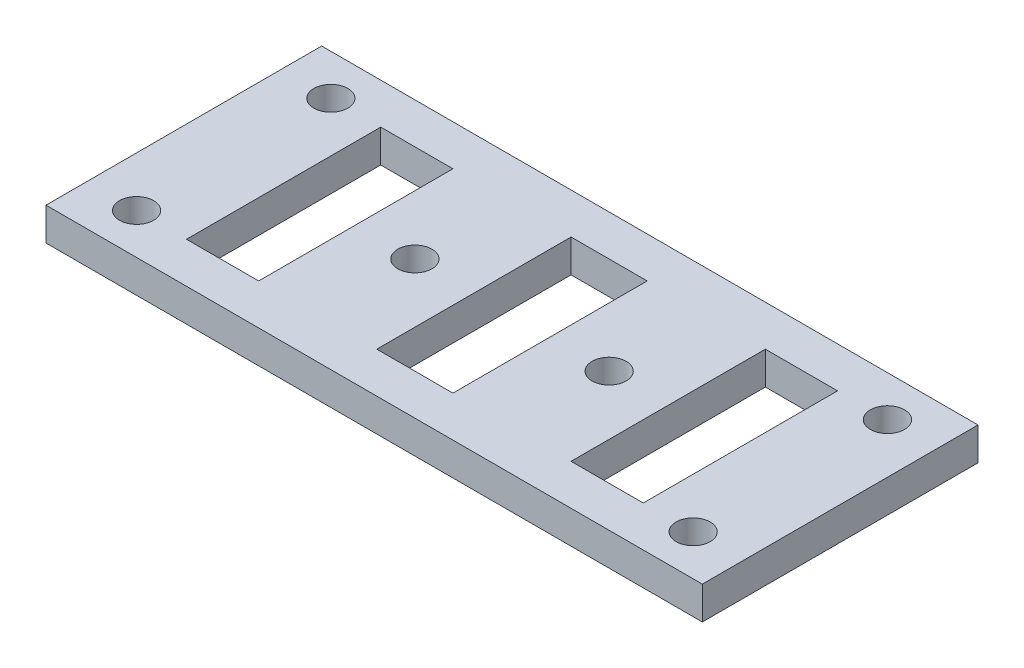
ISO-10303-21;
HEADER;
FILE_DESCRIPTION(('STEP AP214'),'2;1');
FILE_NAME('part.step','',(''),(''),'','','');
FILE_SCHEMA(('AUTOMOTIVE_DESIGN { 1 0 10303 214 1 1 1 1 }'));
ENDSEC;
DATA;
#1=APPLICATION_CONTEXT('core data for automotive mechanical design processes');
#2=APPLICATION_PROTOCOL_DEFINITION('international standard','automotive_design',2000,#1);
#3=PRODUCT_CONTEXT('',#1,'mechanical');
#4=PRODUCT('Part','Part','',(#3));
#5=PRODUCT_RELATED_PRODUCT_CATEGORY('part','',(#4));
#6=PRODUCT_DEFINITION_FORMATION('','',#4);
#7=PRODUCT_DEFINITION_CONTEXT('part definition',#1,'design');
#8=PRODUCT_DEFINITION('design','',#6,#7);
#9=PRODUCT_DEFINITION_SHAPE('','',#8);
#10=(LENGTH_UNIT() NAMED_UNIT(*) SI_UNIT(.MILLI.,.METRE.));
#11=(NAMED_UNIT(*) PLANE_ANGLE_UNIT() SI_UNIT($,.RADIAN.));
#12=(NAMED_UNIT(*) SI_UNIT($,.STERADIAN.) SOLID_ANGLE_UNIT());
#13=UNCERTAINTY_MEASURE_WITH_UNIT(LENGTH_MEASURE(1.E-05),#10,'distance_accuracy_value','');
#14=(GEOMETRIC_REPRESENTATION_CONTEXT(3) GLOBAL_UNCERTAINTY_ASSIGNED_CONTEXT((#13)) GLOBAL_UNIT_ASSIGNED_CONTEXT((#10,
#11,#12)) REPRESENTATION_CONTEXT('',''));
#15=CARTESIAN_POINT('',(0.,0.,0.));
#16=DIRECTION('',(0.,0.,1.));
#17=DIRECTION('',(1.,0.,0.));
#18=AXIS2_PLACEMENT_3D('',#15,#16,#17);
#19=CARTESIAN_POINT('',(0.,6.35,0.));
#20=DIRECTION('',(0.,1.,0.));
#21=DIRECTION('',(0.,0.,1.));
#22=AXIS2_PLACEMENT_3D('',#19,#20,#21);
#23=PLANE('',#22);
#24=DIRECTION('',(-1.,0.,0.));
#25=VECTOR('',#24,1.);
#26=CARTESIAN_POINT('',(52.4685050596531,6.35,-28.0677429234167));
#27=LINE('',#26,#25);
#28=CARTESIAN_POINT('',(52.4685050596531,6.35,-28.0677429234167));
#29=VERTEX_POINT('',#28);
#30=CARTESIAN_POINT('',(38.4985050596531,6.35,-28.0677429234167));
#31=VERTEX_POINT('',#30);
#32=EDGE_CURVE('E184',#29,#31,#27,.T.);
#33=ORIENTED_EDGE('',*,*,#32,.F.);
#34=DIRECTION('',(0.,0.,-1.));
#35=VECTOR('',#34,1.);
#36=CARTESIAN_POINT('',(52.4685050596531,6.35,9.52425707658328));
#37=LINE('',#36,#35);
#38=CARTESIAN_POINT('',(52.4685050596531,6.35,9.52425707658328));
#39=VERTEX_POINT('',#38);
#40=EDGE_CURVE('E182',#39,#29,#37,.T.);
#41=ORIENTED_EDGE('',*,*,#40,.F.);
#42=DIRECTION('',(1.,0.,0.));
#43=VECTOR('',#42,1.);
#44=CARTESIAN_POINT('',(52.4685050596531,6.35,9.52425707658328));
#45=LINE('',#44,#43);
#46=CARTESIAN_POINT('',(38.4985050596531,6.35,9.52425707658328));
#47=VERTEX_POINT('',#46);
#48=EDGE_CURVE('E190',#47,#39,#45,.T.);
#49=ORIENTED_EDGE('',*,*,#48,.F.);
#50=DIRECTION('',(0.,0.,1.));
#51=VECTOR('',#50,1.);
#52=CARTESIAN_POINT('',(38.4985050596531,6.35,9.52425707658328));
#53=LINE('',#52,#51);
#54=EDGE_CURVE('E187',#31,#47,#53,.T.);
#55=ORIENTED_EDGE('',*,*,#54,.F.);
#56=EDGE_LOOP('',(#33,#41,#49,#55));
#57=FACE_BOUND('',#56,.T.);
#58=CARTESIAN_POINT('',(27.0685050596531,6.35,-9.27174292341671));
#59=DIRECTION('',(0.,1.,0.));
#60=DIRECTION('',(0.,0.,1.));
#61=AXIS2_PLACEMENT_3D('',#58,#59,#60);
#62=CIRCLE('',#61,3.302);
#63=CARTESIAN_POINT('',(27.0685050596531,6.35,-5.96974292341672));
#64=VERTEX_POINT('',#63);
#65=EDGE_CURVE('E244',#64,#64,#62,.T.);
#66=ORIENTED_EDGE('',*,*,#65,.F.);
#67=EDGE_LOOP('',(#66));
#68=FACE_BOUND('',#67,.T.);
#69=CARTESIAN_POINT('',(62.1205050596531,6.35,-28.0677429234167));
#70=DIRECTION('',(0.,1.,0.));
#71=DIRECTION('',(0.,0.,1.));
#72=AXIS2_PLACEMENT_3D('',#69,#70,#71);
#73=CIRCLE('',#72,3.302);
#74=CARTESIAN_POINT('',(62.1205050596531,6.35,-24.7657429234167));
#75=VERTEX_POINT('',#74);
#76=EDGE_CURVE('E256',#75,#75,#73,.T.);
#77=ORIENTED_EDGE('',*,*,#76,.F.);
#78=EDGE_LOOP('',(#77));
#79=FACE_BOUND('',#78,.T.);
#80=CARTESIAN_POINT('',(-45.5754949403469,6.35,-28.0677429234167));
#81=DIRECTION('',(0.,1.,0.));
#82=DIRECTION('',(0.,0.,1.));
#83=AXIS2_PLACEMENT_3D('',#80,#81,#82);
#84=CIRCLE('',#83,3.302);
#85=CARTESIAN_POINT('',(-45.5754949403469,6.35,-24.7657429234167));
#86=VERTEX_POINT('',#85);
#87=EDGE_CURVE('E268',#86,#86,#84,.T.);
#88=ORIENTED_EDGE('',*,*,#87,.F.);
#89=EDGE_LOOP('',(#88));
#90=FACE_BOUND('',#89,.T.);
#91=DIRECTION('',(0.,0.,1.));
#92=VECTOR('',#91,1.);
#93=CARTESIAN_POINT('',(-55.2274949403469,6.35,-35.9417429234167));
#94=LINE('',#93,#92);
#95=CARTESIAN_POINT('',(-55.2274949403469,6.35,-35.9417429234167));
#96=VERTEX_POINT('',#95);
#97=CARTESIAN_POINT('',(-55.2274949403469,6.35,17.3982570765833));
#98=VERTEX_POINT('',#97);
#99=EDGE_CURVE('E280',#96,#98,#94,.T.);
#100=ORIENTED_EDGE('',*,*,#99,.T.);
#101=DIRECTION('',(1.,0.,0.));
#102=VECTOR('',#101,1.);
#103=CARTESIAN_POINT('',(-55.2274949403469,6.35,17.3982570765833));
#104=LINE('',#103,#102);
#105=CARTESIAN_POINT('',(71.7725050596531,6.35,17.3982570765833));
#106=VERTEX_POINT('',#105);
#107=EDGE_CURVE('E283',#98,#106,#104,.T.);
#108=ORIENTED_EDGE('',*,*,#107,.T.);
#109=DIRECTION('',(0.,0.,-1.));
#110=VECTOR('',#109,1.);
#111=CARTESIAN_POINT('',(71.7725050596531,6.35,-35.9417429234167));
#112=LINE('',#111,#110);
#113=CARTESIAN_POINT('',(71.7725050596531,6.35,-35.9417429234167));
#114=VERTEX_POINT('',#113);
#115=EDGE_CURVE('E286',#106,#114,#112,.T.);
#116=ORIENTED_EDGE('',*,*,#115,.T.);
#117=DIRECTION('',(-1.,0.,0.));
#118=VECTOR('',#117,1.);
#119=CARTESIAN_POINT('',(-55.2274949403469,6.35,-35.9417429234167));
#120=LINE('',#119,#118);
#121=EDGE_CURVE('E288',#114,#96,#120,.T.);
#122=ORIENTED_EDGE('',*,*,#121,.T.);
#123=EDGE_LOOP('',(#100,#108,#116,#122));
#124=FACE_BOUND('',#123,.T.);
#125=CARTESIAN_POINT('',(-45.5754949403469,6.35,9.52425707658328));
#126=DIRECTION('',(0.,1.,0.));
#127=DIRECTION('',(0.,0.,1.));
#128=AXIS2_PLACEMENT_3D('',#125,#126,#127);
#129=CIRCLE('',#128,3.302);
#130=CARTESIAN_POINT('',(-45.5754949403469,6.35,12.8262570765833));
#131=VERTEX_POINT('',#130);
#132=EDGE_CURVE('E274',#131,#131,#129,.T.);
#133=ORIENTED_EDGE('',*,*,#132,.F.);
#134=EDGE_LOOP('',(#133));
#135=FACE_BOUND('',#134,.T.);
#136=CARTESIAN_POINT('',(62.1205050596531,6.35,9.52425707658328));
#137=DIRECTION('',(0.,1.,0.));
#138=DIRECTION('',(0.,0.,1.));
#139=AXIS2_PLACEMENT_3D('',#136,#137,#138);
#140=CIRCLE('',#139,3.302);
#141=CARTESIAN_POINT('',(62.1205050596531,6.35,12.8262570765833));
#142=VERTEX_POINT('',#141);
#143=EDGE_CURVE('E262',#142,#142,#140,.T.);
#144=ORIENTED_EDGE('',*,*,#143,.F.);
#145=EDGE_LOOP('',(#144));
#146=FACE_BOUND('',#145,.T.);
#147=CARTESIAN_POINT('',(-10.5234949403469,6.35,-9.27174292341672));
#148=DIRECTION('',(0.,1.,0.));
#149=DIRECTION('',(0.,0.,1.));
#150=AXIS2_PLACEMENT_3D('',#147,#148,#149);
#151=CIRCLE('',#150,3.302);
#152=CARTESIAN_POINT('',(-10.5234949403469,6.35,-5.96974292341672));
#153=VERTEX_POINT('',#152);
#154=EDGE_CURVE('E250',#153,#153,#151,.T.);
#155=ORIENTED_EDGE('',*,*,#154,.F.);
#156=EDGE_LOOP('',(#155));
#157=FACE_BOUND('',#156,.T.);
#158=DIRECTION('',(1.,0.,0.));
#159=VECTOR('',#158,1.);
#160=CARTESIAN_POINT('',(-35.9234949403469,6.35,9.52425707658328));
#161=LINE('',#160,#159);
#162=CARTESIAN_POINT('',(-35.9234949403469,6.35,9.52425707658328));
#163=VERTEX_POINT('',#162);
#164=CARTESIAN_POINT('',(-21.9534949403469,6.35,9.52425707658328));
#165=VERTEX_POINT('',#164);
#166=EDGE_CURVE('E215',#163,#165,#161,.T.);
#167=ORIENTED_EDGE('',*,*,#166,.F.);
#168=DIRECTION('',(0.,0.,1.));
#169=VECTOR('',#168,1.);
#170=CARTESIAN_POINT('',(-35.9234949403469,6.35,9.52425707658328));
#171=LINE('',#170,#169);
#172=CARTESIAN_POINT('',(-35.9234949403469,6.35,-28.0677429234167));
#173=VERTEX_POINT('',#172);
#174=EDGE_CURVE('E213',#173,#163,#171,.T.);
#175=ORIENTED_EDGE('',*,*,#174,.F.);
#176=DIRECTION('',(-1.,0.,0.));
#177=VECTOR('',#176,1.);
#178=CARTESIAN_POINT('',(-35.9234949403469,6.35,-28.0677429234167));
#179=LINE('',#178,#177);
#180=CARTESIAN_POINT('',(-21.9534949403469,6.35,-28.0677429234167));
#181=VERTEX_POINT('',#180);
#182=EDGE_CURVE('E221',#181,#173,#179,.T.);
#183=ORIENTED_EDGE('',*,*,#182,.F.);
#184=DIRECTION('',(0.,0.,-1.));
#185=VECTOR('',#184,1.);
#186=CARTESIAN_POINT('',(-21.9534949403469,6.35,9.52425707658328));
#187=LINE('',#186,#185);
#188=EDGE_CURVE('E218',#165,#181,#187,.T.);
#189=ORIENTED_EDGE('',*,*,#188,.F.);
#190=EDGE_LOOP('',(#167,#175,#183,#189));
#191=FACE_BOUND('',#190,.T.);
#192=DIRECTION('',(1.,0.,0.));
#193=VECTOR('',#192,1.);
#194=CARTESIAN_POINT('',(0.906505059653107,6.35,9.52425707658328));
#195=LINE('',#194,#193);
#196=CARTESIAN_POINT('',(0.906505059653107,6.35,9.52425707658328));
#197=VERTEX_POINT('',#196);
#198=CARTESIAN_POINT('',(15.6385050596531,6.35,9.52425707658328));
#199=VERTEX_POINT('',#198);
#200=EDGE_CURVE('E154',#197,#199,#195,.T.);
#201=ORIENTED_EDGE('',*,*,#200,.F.);
#202=DIRECTION('',(0.,0.,1.));
#203=VECTOR('',#202,1.);
#204=CARTESIAN_POINT('',(0.906505059653107,6.35,9.52425707658328));
#205=LINE('',#204,#203);
#206=CARTESIAN_POINT('',(0.906505059653107,6.35,-28.0677429234167));
#207=VERTEX_POINT('',#206);
#208=EDGE_CURVE('E146',#207,#197,#205,.T.);
#209=ORIENTED_EDGE('',*,*,#208,.F.);
#210=DIRECTION('',(-1.,0.,0.));
#211=VECTOR('',#210,1.);
#212=CARTESIAN_POINT('',(0.906505059653107,6.35,-28.0677429234167));
#213=LINE('',#212,#211);
#214=CARTESIAN_POINT('',(15.6385050596531,6.35,-28.0677429234167));
#215=VERTEX_POINT('',#214);
#216=EDGE_CURVE('E168',#215,#207,#213,.T.);
#217=ORIENTED_EDGE('',*,*,#216,.F.);
#218=DIRECTION('',(0.,0.,-1.));
#219=VECTOR('',#218,1.);
#220=CARTESIAN_POINT('',(15.6385050596531,6.35,9.52425707658328));
#221=LINE('',#220,#219);
#222=EDGE_CURVE('E166',#199,#215,#221,.T.);
#223=ORIENTED_EDGE('',*,*,#222,.F.);
#224=EDGE_LOOP('',(#201,#209,#217,#223));
#225=FACE_BOUND('',#224,.T.);
#226=ADVANCED_FACE('F33',(#57,#68,#79,#90,#124,#135,#146,#157,#191,#225),#23,.T.);
#227=CARTESIAN_POINT('',(0.,0.,0.));
#228=DIRECTION('',(0.,1.,0.));
#229=DIRECTION('',(0.,0.,1.));
#230=AXIS2_PLACEMENT_3D('',#227,#228,#229);
#231=PLANE('',#230);
#232=DIRECTION('',(0.,0.,-1.));
#233=VECTOR('',#232,1.);
#234=CARTESIAN_POINT('',(52.4685050596531,0.,9.52425707658328));
#235=LINE('',#234,#233);
#236=CARTESIAN_POINT('',(52.4685050596531,0.,9.52425707658328));
#237=VERTEX_POINT('',#236);
#238=CARTESIAN_POINT('',(52.4685050596531,0.,-28.0677429234167));
#239=VERTEX_POINT('',#238);
#240=EDGE_CURVE('E162',#237,#239,#235,.T.);
#241=ORIENTED_EDGE('',*,*,#240,.T.);
#242=DIRECTION('',(-1.,0.,0.));
#243=VECTOR('',#242,1.);
#244=CARTESIAN_POINT('',(52.4685050596531,0.,-28.0677429234167));
#245=LINE('',#244,#243);
#246=CARTESIAN_POINT('',(38.4985050596531,0.,-28.0677429234167));
#247=VERTEX_POINT('',#246);
#248=EDGE_CURVE('E195',#239,#247,#245,.T.);
#249=ORIENTED_EDGE('',*,*,#248,.T.);
#250=DIRECTION('',(0.,0.,1.));
#251=VECTOR('',#250,1.);
#252=CARTESIAN_POINT('',(38.4985050596531,0.,9.52425707658328));
#253=LINE('',#252,#251);
#254=CARTESIAN_POINT('',(38.4985050596531,0.,9.52425707658328));
#255=VERTEX_POINT('',#254);
#256=EDGE_CURVE('E198',#247,#255,#253,.T.);
#257=ORIENTED_EDGE('',*,*,#256,.T.);
#258=DIRECTION('',(1.,0.,0.));
#259=VECTOR('',#258,1.);
#260=CARTESIAN_POINT('',(52.4685050596531,0.,9.52425707658328));
#261=LINE('',#260,#259);
#262=EDGE_CURVE('E185',#255,#237,#261,.T.);
#263=ORIENTED_EDGE('',*,*,#262,.T.);
#264=EDGE_LOOP('',(#241,#249,#257,#263));
#265=FACE_BOUND('',#264,.T.);
#266=CARTESIAN_POINT('',(27.0685050596531,0.,-9.27174292341671));
#267=DIRECTION('',(0.,1.,0.));
#268=DIRECTION('',(0.,0.,1.));
#269=AXIS2_PLACEMENT_3D('',#266,#267,#268);
#270=CIRCLE('',#269,3.302);
#271=CARTESIAN_POINT('',(27.0685050596531,0.,-5.96974292341672));
#272=VERTEX_POINT('',#271);
#273=EDGE_CURVE('E243',#272,#272,#270,.T.);
#274=ORIENTED_EDGE('',*,*,#273,.T.);
#275=EDGE_LOOP('',(#274));
#276=FACE_BOUND('',#275,.T.);
#277=CARTESIAN_POINT('',(62.1205050596531,0.,-28.0677429234167));
#278=DIRECTION('',(0.,1.,0.));
#279=DIRECTION('',(0.,0.,1.));
#280=AXIS2_PLACEMENT_3D('',#277,#278,#279);
#281=CIRCLE('',#280,3.302);
#282=CARTESIAN_POINT('',(62.1205050596531,0.,-24.7657429234167));
#283=VERTEX_POINT('',#282);
#284=EDGE_CURVE('E253',#283,#283,#281,.T.);
#285=ORIENTED_EDGE('',*,*,#284,.T.);
#286=EDGE_LOOP('',(#285));
#287=FACE_BOUND('',#286,.T.);
#288=CARTESIAN_POINT('',(-45.5754949403469,0.,-28.0677429234167));
#289=DIRECTION('',(0.,1.,0.));
#290=DIRECTION('',(0.,0.,1.));
#291=AXIS2_PLACEMENT_3D('',#288,#289,#290);
#292=CIRCLE('',#291,3.302);
#293=CARTESIAN_POINT('',(-45.5754949403469,0.,-24.7657429234167));
#294=VERTEX_POINT('',#293);
#295=EDGE_CURVE('E265',#294,#294,#292,.T.);
#296=ORIENTED_EDGE('',*,*,#295,.T.);
#297=EDGE_LOOP('',(#296));
#298=FACE_BOUND('',#297,.T.);
#299=DIRECTION('',(0.,0.,1.));
#300=VECTOR('',#299,1.);
#301=CARTESIAN_POINT('',(-55.2274949403469,0.,-35.9417429234167));
#302=LINE('',#301,#300);
#303=CARTESIAN_POINT('',(-55.2274949403469,0.,-35.9417429234167));
#304=VERTEX_POINT('',#303);
#305=CARTESIAN_POINT('',(-55.2274949403469,0.,17.3982570765833));
#306=VERTEX_POINT('',#305);
#307=EDGE_CURVE('E277',#304,#306,#302,.T.);
#308=ORIENTED_EDGE('',*,*,#307,.F.);
#309=DIRECTION('',(-1.,0.,0.));
#310=VECTOR('',#309,1.);
#311=CARTESIAN_POINT('',(-55.2274949403469,0.,-35.9417429234167));
#312=LINE('',#311,#310);
#313=CARTESIAN_POINT('',(71.7725050596531,0.,-35.9417429234167));
#314=VERTEX_POINT('',#313);
#315=EDGE_CURVE('E284',#314,#304,#312,.T.);
#316=ORIENTED_EDGE('',*,*,#315,.F.);
#317=DIRECTION('',(0.,0.,-1.));
#318=VECTOR('',#317,1.);
#319=CARTESIAN_POINT('',(71.7725050596531,0.,-35.9417429234167));
#320=LINE('',#319,#318);
#321=CARTESIAN_POINT('',(71.7725050596531,0.,17.3982570765833));
#322=VERTEX_POINT('',#321);
#323=EDGE_CURVE('E295',#322,#314,#320,.T.);
#324=ORIENTED_EDGE('',*,*,#323,.F.);
#325=DIRECTION('',(1.,0.,0.));
#326=VECTOR('',#325,1.);
#327=CARTESIAN_POINT('',(-55.2274949403469,0.,17.3982570765833));
#328=LINE('',#327,#326);
#329=EDGE_CURVE('E293',#306,#322,#328,.T.);
#330=ORIENTED_EDGE('',*,*,#329,.F.);
#331=EDGE_LOOP('',(#308,#316,#324,#330));
#332=FACE_BOUND('',#331,.T.);
#333=CARTESIAN_POINT('',(-45.5754949403469,0.,9.52425707658328));
#334=DIRECTION('',(0.,1.,0.));
#335=DIRECTION('',(0.,0.,1.));
#336=AXIS2_PLACEMENT_3D('',#333,#334,#335);
#337=CIRCLE('',#336,3.302);
#338=CARTESIAN_POINT('',(-45.5754949403469,0.,12.8262570765833));
#339=VERTEX_POINT('',#338);
#340=EDGE_CURVE('E271',#339,#339,#337,.T.);
#341=ORIENTED_EDGE('',*,*,#340,.T.);
#342=EDGE_LOOP('',(#341));
#343=FACE_BOUND('',#342,.T.);
#344=CARTESIAN_POINT('',(62.1205050596531,0.,9.52425707658328));
#345=DIRECTION('',(0.,1.,0.));
#346=DIRECTION('',(0.,0.,1.));
#347=AXIS2_PLACEMENT_3D('',#344,#345,#346);
#348=CIRCLE('',#347,3.302);
#349=CARTESIAN_POINT('',(62.1205050596531,0.,12.8262570765833));
#350=VERTEX_POINT('',#349);
#351=EDGE_CURVE('E259',#350,#350,#348,.T.);
#352=ORIENTED_EDGE('',*,*,#351,.T.);
#353=EDGE_LOOP('',(#352));
#354=FACE_BOUND('',#353,.T.);
#355=CARTESIAN_POINT('',(-10.5234949403469,0.,-9.27174292341672));
#356=DIRECTION('',(0.,1.,0.));
#357=DIRECTION('',(0.,0.,1.));
#358=AXIS2_PLACEMENT_3D('',#355,#356,#357);
#359=CIRCLE('',#358,3.302);
#360=CARTESIAN_POINT('',(-10.5234949403469,0.,-5.96974292341672));
#361=VERTEX_POINT('',#360);
#362=EDGE_CURVE('E247',#361,#361,#359,.T.);
#363=ORIENTED_EDGE('',*,*,#362,.T.);
#364=EDGE_LOOP('',(#363));
#365=FACE_BOUND('',#364,.T.);
#366=DIRECTION('',(0.,0.,1.));
#367=VECTOR('',#366,1.);
#368=CARTESIAN_POINT('',(-35.9234949403469,0.,9.52425707658328));
#369=LINE('',#368,#367);
#370=CARTESIAN_POINT('',(-35.9234949403469,0.,-28.0677429234167));
#371=VERTEX_POINT('',#370);
#372=CARTESIAN_POINT('',(-35.9234949403469,0.,9.52425707658328));
#373=VERTEX_POINT('',#372);
#374=EDGE_CURVE('E212',#371,#373,#369,.T.);
#375=ORIENTED_EDGE('',*,*,#374,.T.);
#376=DIRECTION('',(1.,0.,0.));
#377=VECTOR('',#376,1.);
#378=CARTESIAN_POINT('',(-35.9234949403469,0.,9.52425707658328));
#379=LINE('',#378,#377);
#380=CARTESIAN_POINT('',(-21.9534949403469,0.,9.52425707658328));
#381=VERTEX_POINT('',#380);
#382=EDGE_CURVE('E226',#373,#381,#379,.T.);
#383=ORIENTED_EDGE('',*,*,#382,.T.);
#384=DIRECTION('',(0.,0.,-1.));
#385=VECTOR('',#384,1.);
#386=CARTESIAN_POINT('',(-21.9534949403469,0.,9.52425707658328));
#387=LINE('',#386,#385);
#388=CARTESIAN_POINT('',(-21.9534949403469,0.,-28.0677429234167));
#389=VERTEX_POINT('',#388);
#390=EDGE_CURVE('E229',#381,#389,#387,.T.);
#391=ORIENTED_EDGE('',*,*,#390,.T.);
#392=DIRECTION('',(-1.,0.,0.));
#393=VECTOR('',#392,1.);
#394=CARTESIAN_POINT('',(-35.9234949403469,0.,-28.0677429234167));
#395=LINE('',#394,#393);
#396=EDGE_CURVE('E216',#389,#371,#395,.T.);
#397=ORIENTED_EDGE('',*,*,#396,.T.);
#398=EDGE_LOOP('',(#375,#383,#391,#397));
#399=FACE_BOUND('',#398,.T.);
#400=DIRECTION('',(0.,0.,1.));
#401=VECTOR('',#400,1.);
#402=CARTESIAN_POINT('',(0.906505059653107,0.,9.52425707658328));
#403=LINE('',#402,#401);
#404=CARTESIAN_POINT('',(0.906505059653107,0.,-28.0677429234167));
#405=VERTEX_POINT('',#404);
#406=CARTESIAN_POINT('',(0.906505059653107,0.,9.52425707658328));
#407=VERTEX_POINT('',#406);
#408=EDGE_CURVE('E56',#405,#407,#403,.T.);
#409=ORIENTED_EDGE('',*,*,#408,.T.);
#410=DIRECTION('',(1.,0.,0.));
#411=VECTOR('',#410,1.);
#412=CARTESIAN_POINT('',(0.906505059653107,0.,9.52425707658328));
#413=LINE('',#412,#411);
#414=CARTESIAN_POINT('',(15.6385050596531,0.,9.52425707658328));
#415=VERTEX_POINT('',#414);
#416=EDGE_CURVE('E161',#407,#415,#413,.T.);
#417=ORIENTED_EDGE('',*,*,#416,.T.);
#418=DIRECTION('',(0.,0.,-1.));
#419=VECTOR('',#418,1.);
#420=CARTESIAN_POINT('',(15.6385050596531,0.,9.52425707658328));
#421=LINE('',#420,#419);
#422=CARTESIAN_POINT('',(15.6385050596531,0.,-28.0677429234167));
#423=VERTEX_POINT('',#422);
#424=EDGE_CURVE('E174',#415,#423,#421,.T.);
#425=ORIENTED_EDGE('',*,*,#424,.T.);
#426=DIRECTION('',(-1.,0.,0.));
#427=VECTOR('',#426,1.);
#428=CARTESIAN_POINT('',(0.906505059653107,0.,-28.0677429234167));
#429=LINE('',#428,#427);
#430=EDGE_CURVE('E155',#423,#405,#429,.T.);
#431=ORIENTED_EDGE('',*,*,#430,.T.);
#432=EDGE_LOOP('',(#409,#417,#425,#431));
#433=FACE_BOUND('',#432,.T.);
#434=ADVANCED_FACE('F313',(#265,#276,#287,#298,#332,#343,#354,#365,#399,#433),#231,.F.);
#435=CARTESIAN_POINT('',(-55.2274949403469,6.35,-35.9417429234167));
#436=DIRECTION('',(1.,0.,0.));
#437=DIRECTION('',(0.,0.,-1.));
#438=AXIS2_PLACEMENT_3D('',#435,#436,#437);
#439=PLANE('',#438);
#440=ORIENTED_EDGE('',*,*,#307,.T.);
#441=DIRECTION('',(0.,-1.,0.));
#442=VECTOR('',#441,1.);
#443=CARTESIAN_POINT('',(-55.2274949403469,6.35,17.3982570765833));
#444=LINE('',#443,#442);
#445=EDGE_CURVE('E11',#98,#306,#444,.T.);
#446=ORIENTED_EDGE('',*,*,#445,.F.);
#447=ORIENTED_EDGE('',*,*,#99,.F.);
#448=DIRECTION('',(0.,-1.,0.));
#449=VECTOR('',#448,1.);
#450=CARTESIAN_POINT('',(-55.2274949403469,6.35,-35.9417429234167));
#451=LINE('',#450,#449);
#452=EDGE_CURVE('E290',#96,#304,#451,.T.);
#453=ORIENTED_EDGE('',*,*,#452,.T.);
#454=EDGE_LOOP('',(#440,#446,#447,#453));
#455=FACE_BOUND('',#454,.T.);
#456=ADVANCED_FACE('F35',(#455),#439,.F.);
#457=CARTESIAN_POINT('',(-55.2274949403469,6.35,17.3982570765833));
#458=DIRECTION('',(0.,0.,-1.));
#459=DIRECTION('',(-1.,0.,0.));
#460=AXIS2_PLACEMENT_3D('',#457,#458,#459);
#461=PLANE('',#460);
#462=ORIENTED_EDGE('',*,*,#329,.T.);
#463=DIRECTION('',(0.,-1.,0.));
#464=VECTOR('',#463,1.);
#465=CARTESIAN_POINT('',(71.7725050596531,6.35,17.3982570765833));
#466=LINE('',#465,#464);
#467=EDGE_CURVE('E41',#106,#322,#466,.T.);
#468=ORIENTED_EDGE('',*,*,#467,.F.);
#469=ORIENTED_EDGE('',*,*,#107,.F.);
#470=ORIENTED_EDGE('',*,*,#445,.T.);
#471=EDGE_LOOP('',(#462,#468,#469,#470));
#472=FACE_BOUND('',#471,.T.);
#473=ADVANCED_FACE('F324',(#472),#461,.F.);
#474=CARTESIAN_POINT('',(71.7725050596531,6.35,-35.9417429234167));
#475=DIRECTION('',(-1.,0.,0.));
#476=DIRECTION('',(0.,0.,1.));
#477=AXIS2_PLACEMENT_3D('',#474,#475,#476);
#478=PLANE('',#477);
#479=ORIENTED_EDGE('',*,*,#323,.T.);
#480=DIRECTION('',(0.,-1.,0.));
#481=VECTOR('',#480,1.);
#482=CARTESIAN_POINT('',(71.7725050596531,6.35,-35.9417429234167));
#483=LINE('',#482,#481);
#484=EDGE_CURVE('E300',#114,#314,#483,.T.);
#485=ORIENTED_EDGE('',*,*,#484,.F.);
#486=ORIENTED_EDGE('',*,*,#115,.F.);
#487=ORIENTED_EDGE('',*,*,#467,.T.);
#488=EDGE_LOOP('',(#479,#485,#486,#487));
#489=FACE_BOUND('',#488,.T.);
#490=ADVANCED_FACE('F307',(#489),#478,.F.);
#491=CARTESIAN_POINT('',(-55.2274949403469,6.35,-35.9417429234167));
#492=DIRECTION('',(0.,0.,1.));
#493=DIRECTION('',(1.,0.,0.));
#494=AXIS2_PLACEMENT_3D('',#491,#492,#493);
#495=PLANE('',#494);
#496=ORIENTED_EDGE('',*,*,#315,.T.);
#497=ORIENTED_EDGE('',*,*,#452,.F.);
#498=ORIENTED_EDGE('',*,*,#121,.F.);
#499=ORIENTED_EDGE('',*,*,#484,.T.);
#500=EDGE_LOOP('',(#496,#497,#498,#499));
#501=FACE_BOUND('',#500,.T.);
#502=ADVANCED_FACE('F317',(#501),#495,.F.);
#503=CARTESIAN_POINT('',(-45.5754949403469,6.35,9.52425707658328));
#504=DIRECTION('',(0.,-1.,0.));
#505=DIRECTION('',(0.,0.,-1.));
#506=AXIS2_PLACEMENT_3D('',#503,#504,#505);
#507=CYLINDRICAL_SURFACE('',#506,3.302);
#508=ORIENTED_EDGE('',*,*,#132,.T.);
#509=EDGE_LOOP('',(#508));
#510=FACE_BOUND('',#509,.T.);
#511=ORIENTED_EDGE('',*,*,#340,.F.);
#512=EDGE_LOOP('',(#511));
#513=FACE_BOUND('',#512,.T.);
#514=ADVANCED_FACE('F342',(#510,#513),#507,.F.);
#515=CARTESIAN_POINT('',(-45.5754949403469,6.35,-28.0677429234167));
#516=DIRECTION('',(0.,-1.,0.));
#517=DIRECTION('',(0.,0.,-1.));
#518=AXIS2_PLACEMENT_3D('',#515,#516,#517);
#519=CYLINDRICAL_SURFACE('',#518,3.302);
#520=ORIENTED_EDGE('',*,*,#87,.T.);
#521=EDGE_LOOP('',(#520));
#522=FACE_BOUND('',#521,.T.);
#523=ORIENTED_EDGE('',*,*,#295,.F.);
#524=EDGE_LOOP('',(#523));
#525=FACE_BOUND('',#524,.T.);
#526=ADVANCED_FACE('F349',(#522,#525),#519,.F.);
#527=CARTESIAN_POINT('',(62.1205050596531,6.35,9.52425707658328));
#528=DIRECTION('',(0.,-1.,0.));
#529=DIRECTION('',(0.,0.,-1.));
#530=AXIS2_PLACEMENT_3D('',#527,#528,#529);
#531=CYLINDRICAL_SURFACE('',#530,3.302);
#532=ORIENTED_EDGE('',*,*,#143,.T.);
#533=EDGE_LOOP('',(#532));
#534=FACE_BOUND('',#533,.T.);
#535=ORIENTED_EDGE('',*,*,#351,.F.);
#536=EDGE_LOOP('',(#535));
#537=FACE_BOUND('',#536,.T.);
#538=ADVANCED_FACE('F354',(#534,#537),#531,.F.);
#539=CARTESIAN_POINT('',(62.1205050596531,6.35,-28.0677429234167));
#540=DIRECTION('',(0.,-1.,0.));
#541=DIRECTION('',(0.,0.,-1.));
#542=AXIS2_PLACEMENT_3D('',#539,#540,#541);
#543=CYLINDRICAL_SURFACE('',#542,3.302);
#544=ORIENTED_EDGE('',*,*,#76,.T.);
#545=EDGE_LOOP('',(#544));
#546=FACE_BOUND('',#545,.T.);
#547=ORIENTED_EDGE('',*,*,#284,.F.);
#548=EDGE_LOOP('',(#547));
#549=FACE_BOUND('',#548,.T.);
#550=ADVANCED_FACE('F419',(#546,#549),#543,.F.);
#551=CARTESIAN_POINT('',(-10.5234949403469,6.35,-9.27174292341672));
#552=DIRECTION('',(0.,-1.,0.));
#553=DIRECTION('',(0.,0.,-1.));
#554=AXIS2_PLACEMENT_3D('',#551,#552,#553);
#555=CYLINDRICAL_SURFACE('',#554,3.302);
#556=ORIENTED_EDGE('',*,*,#154,.T.);
#557=EDGE_LOOP('',(#556));
#558=FACE_BOUND('',#557,.T.);
#559=ORIENTED_EDGE('',*,*,#362,.F.);
#560=EDGE_LOOP('',(#559));
#561=FACE_BOUND('',#560,.T.);
#562=ADVANCED_FACE('F415',(#558,#561),#555,.F.);
#563=CARTESIAN_POINT('',(27.0685050596531,6.35,-9.27174292341671));
#564=DIRECTION('',(0.,-1.,0.));
#565=DIRECTION('',(0.,0.,-1.));
#566=AXIS2_PLACEMENT_3D('',#563,#564,#565);
#567=CYLINDRICAL_SURFACE('',#566,3.302);
#568=ORIENTED_EDGE('',*,*,#65,.T.);
#569=EDGE_LOOP('',(#568));
#570=FACE_BOUND('',#569,.T.);
#571=ORIENTED_EDGE('',*,*,#273,.F.);
#572=EDGE_LOOP('',(#571));
#573=FACE_BOUND('',#572,.T.);
#574=ADVANCED_FACE('F411',(#570,#573),#567,.F.);
#575=CARTESIAN_POINT('',(-35.9234949403469,6.35,9.52425707658328));
#576=DIRECTION('',(1.,0.,0.));
#577=DIRECTION('',(0.,0.,-1.));
#578=AXIS2_PLACEMENT_3D('',#575,#576,#577);
#579=PLANE('',#578);
#580=ORIENTED_EDGE('',*,*,#374,.F.);
#581=DIRECTION('',(0.,-1.,0.));
#582=VECTOR('',#581,1.);
#583=CARTESIAN_POINT('',(-35.9234949403469,6.35,-28.0677429234167));
#584=LINE('',#583,#582);
#585=EDGE_CURVE('E223',#173,#371,#584,.T.);
#586=ORIENTED_EDGE('',*,*,#585,.F.);
#587=ORIENTED_EDGE('',*,*,#174,.T.);
#588=DIRECTION('',(0.,-1.,0.));
#589=VECTOR('',#588,1.);
#590=CARTESIAN_POINT('',(-35.9234949403469,6.35,9.52425707658328));
#591=LINE('',#590,#589);
#592=EDGE_CURVE('E240',#163,#373,#591,.T.);
#593=ORIENTED_EDGE('',*,*,#592,.T.);
#594=EDGE_LOOP('',(#580,#586,#587,#593));
#595=FACE_BOUND('',#594,.T.);
#596=ADVANCED_FACE('F407',(#595),#579,.T.);
#597=CARTESIAN_POINT('',(-35.9234949403469,6.35,9.52425707658328));
#598=DIRECTION('',(0.,0.,-1.));
#599=DIRECTION('',(-1.,0.,0.));
#600=AXIS2_PLACEMENT_3D('',#597,#598,#599);
#601=PLANE('',#600);
#602=ORIENTED_EDGE('',*,*,#382,.F.);
#603=ORIENTED_EDGE('',*,*,#592,.F.);
#604=ORIENTED_EDGE('',*,*,#166,.T.);
#605=DIRECTION('',(0.,-1.,0.));
#606=VECTOR('',#605,1.);
#607=CARTESIAN_POINT('',(-21.9534949403469,6.35,9.52425707658328));
#608=LINE('',#607,#606);
#609=EDGE_CURVE('E238',#165,#381,#608,.T.);
#610=ORIENTED_EDGE('',*,*,#609,.T.);
#611=EDGE_LOOP('',(#602,#603,#604,#610));
#612=FACE_BOUND('',#611,.T.);
#613=ADVANCED_FACE('F403',(#612),#601,.T.);
#614=CARTESIAN_POINT('',(-21.9534949403469,6.35,9.52425707658328));
#615=DIRECTION('',(-1.,0.,0.));
#616=DIRECTION('',(0.,0.,1.));
#617=AXIS2_PLACEMENT_3D('',#614,#615,#616);
#618=PLANE('',#617);
#619=ORIENTED_EDGE('',*,*,#390,.F.);
#620=ORIENTED_EDGE('',*,*,#609,.F.);
#621=ORIENTED_EDGE('',*,*,#188,.T.);
#622=DIRECTION('',(0.,-1.,0.));
#623=VECTOR('',#622,1.);
#624=CARTESIAN_POINT('',(-21.9534949403469,6.35,-28.0677429234167));
#625=LINE('',#624,#623);
#626=EDGE_CURVE('E236',#181,#389,#625,.T.);
#627=ORIENTED_EDGE('',*,*,#626,.T.);
#628=EDGE_LOOP('',(#619,#620,#621,#627));
#629=FACE_BOUND('',#628,.T.);
#630=ADVANCED_FACE('F399',(#629),#618,.T.);
#631=CARTESIAN_POINT('',(-35.9234949403469,6.35,-28.0677429234167));
#632=DIRECTION('',(0.,0.,1.));
#633=DIRECTION('',(1.,0.,0.));
#634=AXIS2_PLACEMENT_3D('',#631,#632,#633);
#635=PLANE('',#634);
#636=ORIENTED_EDGE('',*,*,#396,.F.);
#637=ORIENTED_EDGE('',*,*,#626,.F.);
#638=ORIENTED_EDGE('',*,*,#182,.T.);
#639=ORIENTED_EDGE('',*,*,#585,.T.);
#640=EDGE_LOOP('',(#636,#637,#638,#639));
#641=FACE_BOUND('',#640,.T.);
#642=ADVANCED_FACE('F395',(#641),#635,.T.);
#643=CARTESIAN_POINT('',(52.4685050596531,6.35,9.52425707658328));
#644=DIRECTION('',(-1.,0.,0.));
#645=DIRECTION('',(0.,0.,1.));
#646=AXIS2_PLACEMENT_3D('',#643,#644,#645);
#647=PLANE('',#646);
#648=ORIENTED_EDGE('',*,*,#240,.F.);
#649=DIRECTION('',(0.,-1.,0.));
#650=VECTOR('',#649,1.);
#651=CARTESIAN_POINT('',(52.4685050596531,6.35,9.52425707658328));
#652=LINE('',#651,#650);
#653=EDGE_CURVE('E192',#39,#237,#652,.T.);
#654=ORIENTED_EDGE('',*,*,#653,.F.);
#655=ORIENTED_EDGE('',*,*,#40,.T.);
#656=DIRECTION('',(0.,-1.,0.));
#657=VECTOR('',#656,1.);
#658=CARTESIAN_POINT('',(52.4685050596531,6.35,-28.0677429234167));
#659=LINE('',#658,#657);
#660=EDGE_CURVE('E209',#29,#239,#659,.T.);
#661=ORIENTED_EDGE('',*,*,#660,.T.);
#662=EDGE_LOOP('',(#648,#654,#655,#661));
#663=FACE_BOUND('',#662,.T.);
#664=ADVANCED_FACE('F391',(#663),#647,.T.);
#665=CARTESIAN_POINT('',(52.4685050596531,6.35,-28.0677429234167));
#666=DIRECTION('',(0.,0.,1.));
#667=DIRECTION('',(1.,0.,0.));
#668=AXIS2_PLACEMENT_3D('',#665,#666,#667);
#669=PLANE('',#668);
#670=ORIENTED_EDGE('',*,*,#248,.F.);
#671=ORIENTED_EDGE('',*,*,#660,.F.);
#672=ORIENTED_EDGE('',*,*,#32,.T.);
#673=DIRECTION('',(0.,-1.,0.));
#674=VECTOR('',#673,1.);
#675=CARTESIAN_POINT('',(38.4985050596531,6.35,-28.0677429234167));
#676=LINE('',#675,#674);
#677=EDGE_CURVE('E207',#31,#247,#676,.T.);
#678=ORIENTED_EDGE('',*,*,#677,.T.);
#679=EDGE_LOOP('',(#670,#671,#672,#678));
#680=FACE_BOUND('',#679,.T.);
#681=ADVANCED_FACE('F387',(#680),#669,.T.);
#682=CARTESIAN_POINT('',(38.4985050596531,6.35,9.52425707658328));
#683=DIRECTION('',(1.,0.,0.));
#684=DIRECTION('',(0.,0.,-1.));
#685=AXIS2_PLACEMENT_3D('',#682,#683,#684);
#686=PLANE('',#685);
#687=ORIENTED_EDGE('',*,*,#256,.F.);
#688=ORIENTED_EDGE('',*,*,#677,.F.);
#689=ORIENTED_EDGE('',*,*,#54,.T.);
#690=DIRECTION('',(0.,-1.,0.));
#691=VECTOR('',#690,1.);
#692=CARTESIAN_POINT('',(38.4985050596531,6.35,9.52425707658328));
#693=LINE('',#692,#691);
#694=EDGE_CURVE('E205',#47,#255,#693,.T.);
#695=ORIENTED_EDGE('',*,*,#694,.T.);
#696=EDGE_LOOP('',(#687,#688,#689,#695));
#697=FACE_BOUND('',#696,.T.);
#698=ADVANCED_FACE('F383',(#697),#686,.T.);
#699=CARTESIAN_POINT('',(52.4685050596531,6.35,9.52425707658328));
#700=DIRECTION('',(0.,0.,-1.));
#701=DIRECTION('',(-1.,0.,0.));
#702=AXIS2_PLACEMENT_3D('',#699,#700,#701);
#703=PLANE('',#702);
#704=ORIENTED_EDGE('',*,*,#262,.F.);
#705=ORIENTED_EDGE('',*,*,#694,.F.);
#706=ORIENTED_EDGE('',*,*,#48,.T.);
#707=ORIENTED_EDGE('',*,*,#653,.T.);
#708=EDGE_LOOP('',(#704,#705,#706,#707));
#709=FACE_BOUND('',#708,.T.);
#710=ADVANCED_FACE('F380',(#709),#703,.T.);
#711=CARTESIAN_POINT('',(0.906505059653107,6.35,9.52425707658328));
#712=DIRECTION('',(1.,0.,0.));
#713=DIRECTION('',(0.,0.,-1.));
#714=AXIS2_PLACEMENT_3D('',#711,#712,#713);
#715=PLANE('',#714);
#716=ORIENTED_EDGE('',*,*,#408,.F.);
#717=DIRECTION('',(0.,-1.,0.));
#718=VECTOR('',#717,1.);
#719=CARTESIAN_POINT('',(0.906505059653107,6.35,-28.0677429234167));
#720=LINE('',#719,#718);
#721=EDGE_CURVE('E150',#207,#405,#720,.T.);
#722=ORIENTED_EDGE('',*,*,#721,.F.);
#723=ORIENTED_EDGE('',*,*,#208,.T.);
#724=DIRECTION('',(0.,-1.,0.));
#725=VECTOR('',#724,1.);
#726=CARTESIAN_POINT('',(0.906505059653107,6.35,9.52425707658328));
#727=LINE('',#726,#725);
#728=EDGE_CURVE('E149',#197,#407,#727,.T.);
#729=ORIENTED_EDGE('',*,*,#728,.T.);
#730=EDGE_LOOP('',(#716,#722,#723,#729));
#731=FACE_BOUND('',#730,.T.);
#732=ADVANCED_FACE('F148',(#731),#715,.T.);
#733=CARTESIAN_POINT('',(0.906505059653107,6.35,9.52425707658328));
#734=DIRECTION('',(0.,0.,-1.));
#735=DIRECTION('',(-1.,0.,0.));
#736=AXIS2_PLACEMENT_3D('',#733,#734,#735);
#737=PLANE('',#736);
#738=ORIENTED_EDGE('',*,*,#416,.F.);
#739=ORIENTED_EDGE('',*,*,#728,.F.);
#740=ORIENTED_EDGE('',*,*,#200,.T.);
#741=DIRECTION('',(0.,-1.,0.));
#742=VECTOR('',#741,1.);
#743=CARTESIAN_POINT('',(15.6385050596531,6.35,9.52425707658328));
#744=LINE('',#743,#742);
#745=EDGE_CURVE('E163',#199,#415,#744,.T.);
#746=ORIENTED_EDGE('',*,*,#745,.T.);
#747=EDGE_LOOP('',(#738,#739,#740,#746));
#748=FACE_BOUND('',#747,.T.);
#749=ADVANCED_FACE('F158',(#748),#737,.T.);
#750=CARTESIAN_POINT('',(15.6385050596531,6.35,9.52425707658328));
#751=DIRECTION('',(-1.,0.,0.));
#752=DIRECTION('',(0.,0.,1.));
#753=AXIS2_PLACEMENT_3D('',#750,#751,#752);
#754=PLANE('',#753);
#755=ORIENTED_EDGE('',*,*,#424,.F.);
#756=ORIENTED_EDGE('',*,*,#745,.F.);
#757=ORIENTED_EDGE('',*,*,#222,.T.);
#758=DIRECTION('',(0.,-1.,0.));
#759=VECTOR('',#758,1.);
#760=CARTESIAN_POINT('',(15.6385050596531,6.35,-28.0677429234167));
#761=LINE('',#760,#759);
#762=EDGE_CURVE('E48',#215,#423,#761,.T.);
#763=ORIENTED_EDGE('',*,*,#762,.T.);
#764=EDGE_LOOP('',(#755,#756,#757,#763));
#765=FACE_BOUND('',#764,.T.);
#766=ADVANCED_FACE('F368',(#765),#754,.T.);
#767=CARTESIAN_POINT('',(0.906505059653107,6.35,-28.0677429234167));
#768=DIRECTION('',(0.,0.,1.));
#769=DIRECTION('',(1.,0.,0.));
#770=AXIS2_PLACEMENT_3D('',#767,#768,#769);
#771=PLANE('',#770);
#772=ORIENTED_EDGE('',*,*,#430,.F.);
#773=ORIENTED_EDGE('',*,*,#762,.F.);
#774=ORIENTED_EDGE('',*,*,#216,.T.);
#775=ORIENTED_EDGE('',*,*,#721,.T.);
#776=EDGE_LOOP('',(#772,#773,#774,#775));
#777=FACE_BOUND('',#776,.T.);
#778=ADVANCED_FACE('F366',(#777),#771,.T.);
#779=CLOSED_SHELL('',(#226,#434,#456,#473,#490,#502,#514,#526,#538,#550,#562,#574,#596,#613,
#630,#642,#664,#681,#698,#710,#732,#749,#766,#778));
#780=MANIFOLD_SOLID_BREP('B2',#779);
#781=ADVANCED_BREP_SHAPE_REPRESENTATION('',(#18,#780),#14);
#782=SHAPE_DEFINITION_REPRESENTATION(#9,#781);
ENDSEC;
END-ISO-10303-21;
